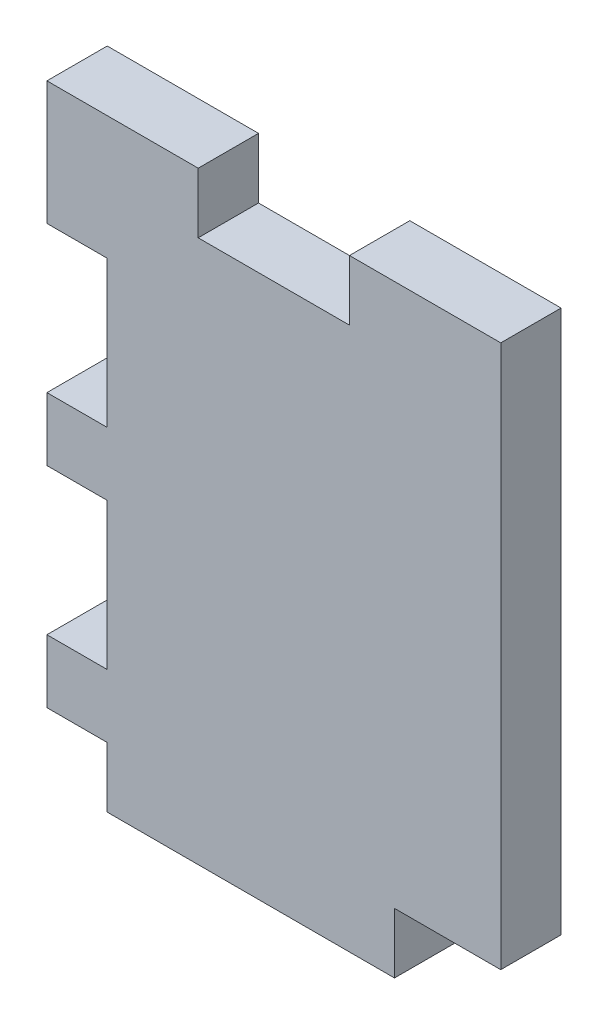
ISO-10303-21;
HEADER;
FILE_DESCRIPTION(('STEP AP214'),'2;1');
FILE_NAME('part.step','',(''),(''),'','','');
FILE_SCHEMA(('AUTOMOTIVE_DESIGN { 1 0 10303 214 1 1 1 1 }'));
ENDSEC;
DATA;
#1=APPLICATION_CONTEXT('core data for automotive mechanical design processes');
#2=APPLICATION_PROTOCOL_DEFINITION('international standard','automotive_design',2000,#1);
#3=PRODUCT_CONTEXT('',#1,'mechanical');
#4=PRODUCT('Part','Part','',(#3));
#5=PRODUCT_RELATED_PRODUCT_CATEGORY('part','',(#4));
#6=PRODUCT_DEFINITION_FORMATION('','',#4);
#7=PRODUCT_DEFINITION_CONTEXT('part definition',#1,'design');
#8=PRODUCT_DEFINITION('design','',#6,#7);
#9=PRODUCT_DEFINITION_SHAPE('','',#8);
#10=(LENGTH_UNIT() NAMED_UNIT(*) SI_UNIT(.MILLI.,.METRE.));
#11=(NAMED_UNIT(*) PLANE_ANGLE_UNIT() SI_UNIT($,.RADIAN.));
#12=(NAMED_UNIT(*) SI_UNIT($,.STERADIAN.) SOLID_ANGLE_UNIT());
#13=UNCERTAINTY_MEASURE_WITH_UNIT(LENGTH_MEASURE(1.E-05),#10,'distance_accuracy_value','');
#14=(GEOMETRIC_REPRESENTATION_CONTEXT(3) GLOBAL_UNCERTAINTY_ASSIGNED_CONTEXT((#13)) GLOBAL_UNIT_ASSIGNED_CONTEXT((#10,
#11,#12)) REPRESENTATION_CONTEXT('',''));
#15=CARTESIAN_POINT('',(0.,0.,0.));
#16=DIRECTION('',(0.,0.,1.));
#17=DIRECTION('',(1.,0.,0.));
#18=AXIS2_PLACEMENT_3D('',#15,#16,#17);
#19=CARTESIAN_POINT('',(0.,53.34,5.334));
#20=DIRECTION('',(0.,1.,0.));
#21=DIRECTION('',(0.,0.,1.));
#22=AXIS2_PLACEMENT_3D('',#19,#20,#21);
#23=PLANE('',#22);
#24=DIRECTION('',(0.,0.,1.));
#25=VECTOR('',#24,1.);
#26=CARTESIAN_POINT('',(13.3773333333333,53.34,0.));
#27=LINE('',#26,#25);
#28=CARTESIAN_POINT('',(13.3773333333333,53.34,0.));
#29=VERTEX_POINT('',#28);
#30=CARTESIAN_POINT('',(13.3773333333333,53.34,5.334));
#31=VERTEX_POINT('',#30);
#32=EDGE_CURVE('E205',#29,#31,#27,.T.);
#33=ORIENTED_EDGE('',*,*,#32,.F.);
#34=DIRECTION('',(1.,0.,0.));
#35=VECTOR('',#34,1.);
#36=CARTESIAN_POINT('',(0.,53.34,0.));
#37=LINE('',#36,#35);
#38=CARTESIAN_POINT('',(0.,53.34,0.));
#39=VERTEX_POINT('',#38);
#40=EDGE_CURVE('E197',#39,#29,#37,.T.);
#41=ORIENTED_EDGE('',*,*,#40,.F.);
#42=DIRECTION('',(0.,0.,-1.));
#43=VECTOR('',#42,1.);
#44=CARTESIAN_POINT('',(0.,53.34,5.334));
#45=LINE('',#44,#43);
#46=CARTESIAN_POINT('',(0.,53.34,5.334));
#47=VERTEX_POINT('',#46);
#48=EDGE_CURVE('E45',#47,#39,#45,.T.);
#49=ORIENTED_EDGE('',*,*,#48,.F.);
#50=DIRECTION('',(1.,0.,0.));
#51=VECTOR('',#50,1.);
#52=CARTESIAN_POINT('',(0.,53.34,5.334));
#53=LINE('',#52,#51);
#54=EDGE_CURVE('E306',#47,#31,#53,.T.);
#55=ORIENTED_EDGE('',*,*,#54,.T.);
#56=EDGE_LOOP('',(#33,#41,#49,#55));
#57=FACE_BOUND('',#56,.T.);
#58=ADVANCED_FACE('F37',(#57),#23,.T.);
#59=CARTESIAN_POINT('',(0.,0.,5.334));
#60=DIRECTION('',(-1.,0.,0.));
#61=DIRECTION('',(0.,-1.,0.));
#62=AXIS2_PLACEMENT_3D('',#59,#60,#61);
#63=PLANE('',#62);
#64=DIRECTION('',(0.,1.,0.));
#65=VECTOR('',#64,1.);
#66=CARTESIAN_POINT('',(0.,0.,0.));
#67=LINE('',#66,#65);
#68=CARTESIAN_POINT('',(0.,42.418,0.));
#69=VERTEX_POINT('',#68);
#70=EDGE_CURVE('E321',#69,#39,#67,.T.);
#71=ORIENTED_EDGE('',*,*,#70,.F.);
#72=DIRECTION('',(0.,0.,1.));
#73=VECTOR('',#72,1.);
#74=CARTESIAN_POINT('',(0.,42.418,0.));
#75=LINE('',#74,#73);
#76=CARTESIAN_POINT('',(0.,42.418,5.334));
#77=VERTEX_POINT('',#76);
#78=EDGE_CURVE('E232',#69,#77,#75,.T.);
#79=ORIENTED_EDGE('',*,*,#78,.T.);
#80=DIRECTION('',(0.,1.,0.));
#81=VECTOR('',#80,1.);
#82=CARTESIAN_POINT('',(0.,0.,5.334));
#83=LINE('',#82,#81);
#84=EDGE_CURVE('E309',#77,#47,#83,.T.);
#85=ORIENTED_EDGE('',*,*,#84,.T.);
#86=ORIENTED_EDGE('',*,*,#48,.T.);
#87=EDGE_LOOP('',(#71,#79,#85,#86));
#88=FACE_BOUND('',#87,.T.);
#89=ADVANCED_FACE('F328',(#88),#63,.T.);
#90=DIRECTION('',(0.,0.,1.));
#91=VECTOR('',#90,1.);
#92=CARTESIAN_POINT('',(0.,29.464,0.));
#93=LINE('',#92,#91);
#94=CARTESIAN_POINT('',(0.,29.464,0.));
#95=VERTEX_POINT('',#94);
#96=CARTESIAN_POINT('',(0.,29.464,5.334));
#97=VERTEX_POINT('',#96);
#98=EDGE_CURVE('E229',#95,#97,#93,.T.);
#99=ORIENTED_EDGE('',*,*,#98,.F.);
#100=CARTESIAN_POINT('',(0.,23.876,0.));
#101=VERTEX_POINT('',#100);
#102=EDGE_CURVE('E323',#101,#95,#67,.T.);
#103=ORIENTED_EDGE('',*,*,#102,.F.);
#104=DIRECTION('',(0.,0.,1.));
#105=VECTOR('',#104,1.);
#106=CARTESIAN_POINT('',(0.,23.876,0.));
#107=LINE('',#106,#105);
#108=CARTESIAN_POINT('',(0.,23.876,5.334));
#109=VERTEX_POINT('',#108);
#110=EDGE_CURVE('E242',#101,#109,#107,.T.);
#111=ORIENTED_EDGE('',*,*,#110,.T.);
#112=EDGE_CURVE('E313',#109,#97,#83,.T.);
#113=ORIENTED_EDGE('',*,*,#112,.T.);
#114=EDGE_LOOP('',(#99,#103,#111,#113));
#115=FACE_BOUND('',#114,.T.);
#116=ADVANCED_FACE('F384',(#115),#63,.T.);
#117=CARTESIAN_POINT('',(0.,0.,5.334));
#118=DIRECTION('',(0.,0.,1.));
#119=DIRECTION('',(1.,0.,0.));
#120=AXIS2_PLACEMENT_3D('',#117,#118,#119);
#121=PLANE('',#120);
#122=DIRECTION('',(0.,-1.,0.));
#123=VECTOR('',#122,1.);
#124=CARTESIAN_POINT('',(13.3773333333333,53.34,5.334));
#125=LINE('',#124,#123);
#126=CARTESIAN_POINT('',(13.3773333333333,48.006,5.334));
#127=VERTEX_POINT('',#126);
#128=EDGE_CURVE('E180',#31,#127,#125,.T.);
#129=ORIENTED_EDGE('',*,*,#128,.F.);
#130=ORIENTED_EDGE('',*,*,#54,.F.);
#131=ORIENTED_EDGE('',*,*,#84,.F.);
#132=DIRECTION('',(1.,0.,0.));
#133=VECTOR('',#132,1.);
#134=CARTESIAN_POINT('',(0.,42.418,5.334));
#135=LINE('',#134,#133);
#136=CARTESIAN_POINT('',(5.334,42.418,5.334));
#137=VERTEX_POINT('',#136);
#138=EDGE_CURVE('E215',#77,#137,#135,.T.);
#139=ORIENTED_EDGE('',*,*,#138,.T.);
#140=DIRECTION('',(0.,-1.,0.));
#141=VECTOR('',#140,1.);
#142=CARTESIAN_POINT('',(5.334,42.418,5.334));
#143=LINE('',#142,#141);
#144=CARTESIAN_POINT('',(5.334,29.464,5.334));
#145=VERTEX_POINT('',#144);
#146=EDGE_CURVE('E223',#137,#145,#143,.T.);
#147=ORIENTED_EDGE('',*,*,#146,.T.);
#148=DIRECTION('',(1.,0.,0.));
#149=VECTOR('',#148,1.);
#150=CARTESIAN_POINT('',(0.,29.464,5.334));
#151=LINE('',#150,#149);
#152=EDGE_CURVE('E220',#97,#145,#151,.T.);
#153=ORIENTED_EDGE('',*,*,#152,.F.);
#154=ORIENTED_EDGE('',*,*,#112,.F.);
#155=DIRECTION('',(1.,0.,0.));
#156=VECTOR('',#155,1.);
#157=CARTESIAN_POINT('',(0.,23.876,5.334));
#158=LINE('',#157,#156);
#159=CARTESIAN_POINT('',(5.334,23.876,5.334));
#160=VERTEX_POINT('',#159);
#161=EDGE_CURVE('E224',#109,#160,#158,.T.);
#162=ORIENTED_EDGE('',*,*,#161,.T.);
#163=DIRECTION('',(0.,1.,0.));
#164=VECTOR('',#163,1.);
#165=CARTESIAN_POINT('',(5.334,10.922,5.334));
#166=LINE('',#165,#164);
#167=CARTESIAN_POINT('',(5.334,10.922,5.334));
#168=VERTEX_POINT('',#167);
#169=EDGE_CURVE('E249',#168,#160,#166,.T.);
#170=ORIENTED_EDGE('',*,*,#169,.F.);
#171=DIRECTION('',(1.,0.,0.));
#172=VECTOR('',#171,1.);
#173=CARTESIAN_POINT('',(0.,10.922,5.334));
#174=LINE('',#173,#172);
#175=CARTESIAN_POINT('',(0.,10.922,5.334));
#176=VERTEX_POINT('',#175);
#177=EDGE_CURVE('E246',#176,#168,#174,.T.);
#178=ORIENTED_EDGE('',*,*,#177,.F.);
#179=CARTESIAN_POINT('',(0.,5.334,5.334));
#180=VERTEX_POINT('',#179);
#181=EDGE_CURVE('E310',#180,#176,#83,.T.);
#182=ORIENTED_EDGE('',*,*,#181,.F.);
#183=DIRECTION('',(1.,0.,0.));
#184=VECTOR('',#183,1.);
#185=CARTESIAN_POINT('',(0.,5.334,5.334));
#186=LINE('',#185,#184);
#187=CARTESIAN_POINT('',(5.334,5.334,5.334));
#188=VERTEX_POINT('',#187);
#189=EDGE_CURVE('E269',#180,#188,#186,.T.);
#190=ORIENTED_EDGE('',*,*,#189,.T.);
#191=DIRECTION('',(0.,1.,0.));
#192=VECTOR('',#191,1.);
#193=CARTESIAN_POINT('',(5.334,0.,5.334));
#194=LINE('',#193,#192);
#195=CARTESIAN_POINT('',(5.334,0.,5.334));
#196=VERTEX_POINT('',#195);
#197=EDGE_CURVE('E265',#196,#188,#194,.T.);
#198=ORIENTED_EDGE('',*,*,#197,.F.);
#199=DIRECTION('',(1.,0.,0.));
#200=VECTOR('',#199,1.);
#201=CARTESIAN_POINT('',(0.,0.,5.334));
#202=LINE('',#201,#200);
#203=CARTESIAN_POINT('',(30.734,0.,5.334));
#204=VERTEX_POINT('',#203);
#205=EDGE_CURVE('E298',#196,#204,#202,.T.);
#206=ORIENTED_EDGE('',*,*,#205,.T.);
#207=DIRECTION('',(0.,1.,0.));
#208=VECTOR('',#207,1.);
#209=CARTESIAN_POINT('',(30.734,0.,5.334));
#210=LINE('',#209,#208);
#211=CARTESIAN_POINT('',(30.734,5.334,5.334));
#212=VERTEX_POINT('',#211);
#213=EDGE_CURVE('E289',#204,#212,#210,.T.);
#214=ORIENTED_EDGE('',*,*,#213,.T.);
#215=DIRECTION('',(-1.,0.,0.));
#216=VECTOR('',#215,1.);
#217=CARTESIAN_POINT('',(40.132,5.334,5.334));
#218=LINE('',#217,#216);
#219=CARTESIAN_POINT('',(40.132,5.334,5.334));
#220=VERTEX_POINT('',#219);
#221=EDGE_CURVE('E272',#220,#212,#218,.T.);
#222=ORIENTED_EDGE('',*,*,#221,.F.);
#223=DIRECTION('',(0.,1.,0.));
#224=VECTOR('',#223,1.);
#225=CARTESIAN_POINT('',(40.132,0.,5.334));
#226=LINE('',#225,#224);
#227=CARTESIAN_POINT('',(40.132,53.34,5.334));
#228=VERTEX_POINT('',#227);
#229=EDGE_CURVE('E301',#220,#228,#226,.T.);
#230=ORIENTED_EDGE('',*,*,#229,.T.);
#231=CARTESIAN_POINT('',(26.7546666666667,53.34,5.334));
#232=VERTEX_POINT('',#231);
#233=EDGE_CURVE('E305',#232,#228,#53,.T.);
#234=ORIENTED_EDGE('',*,*,#233,.F.);
#235=DIRECTION('',(0.,1.,0.));
#236=VECTOR('',#235,1.);
#237=CARTESIAN_POINT('',(26.7546666666667,53.34,5.334));
#238=LINE('',#237,#236);
#239=CARTESIAN_POINT('',(26.7546666666667,48.006,5.334));
#240=VERTEX_POINT('',#239);
#241=EDGE_CURVE('E52',#240,#232,#238,.T.);
#242=ORIENTED_EDGE('',*,*,#241,.F.);
#243=DIRECTION('',(1.,0.,0.));
#244=VECTOR('',#243,1.);
#245=CARTESIAN_POINT('',(13.3773333333333,48.006,5.334));
#246=LINE('',#245,#244);
#247=EDGE_CURVE('E199',#127,#240,#246,.T.);
#248=ORIENTED_EDGE('',*,*,#247,.F.);
#249=EDGE_LOOP('',(#129,#130,#131,#139,#147,#153,#154,#162,#170,#178,#182,#190,#198,#206,#214,
#222,#230,#234,#242,#248));
#250=FACE_BOUND('',#249,.T.);
#251=ADVANCED_FACE('F333',(#250),#121,.T.);
#252=CARTESIAN_POINT('',(0.,0.,0.));
#253=DIRECTION('',(0.,0.,1.));
#254=DIRECTION('',(1.,0.,0.));
#255=AXIS2_PLACEMENT_3D('',#252,#253,#254);
#256=PLANE('',#255);
#257=ORIENTED_EDGE('',*,*,#40,.T.);
#258=DIRECTION('',(0.,-1.,0.));
#259=VECTOR('',#258,1.);
#260=CARTESIAN_POINT('',(13.3773333333333,53.34,0.));
#261=LINE('',#260,#259);
#262=CARTESIAN_POINT('',(13.3773333333333,48.006,0.));
#263=VERTEX_POINT('',#262);
#264=EDGE_CURVE('E177',#29,#263,#261,.T.);
#265=ORIENTED_EDGE('',*,*,#264,.T.);
#266=DIRECTION('',(1.,0.,0.));
#267=VECTOR('',#266,1.);
#268=CARTESIAN_POINT('',(13.3773333333333,48.006,0.));
#269=LINE('',#268,#267);
#270=CARTESIAN_POINT('',(26.7546666666667,48.006,0.));
#271=VERTEX_POINT('',#270);
#272=EDGE_CURVE('E188',#263,#271,#269,.T.);
#273=ORIENTED_EDGE('',*,*,#272,.T.);
#274=DIRECTION('',(0.,1.,0.));
#275=VECTOR('',#274,1.);
#276=CARTESIAN_POINT('',(26.7546666666667,53.34,0.));
#277=LINE('',#276,#275);
#278=CARTESIAN_POINT('',(26.7546666666667,53.34,0.));
#279=VERTEX_POINT('',#278);
#280=EDGE_CURVE('E185',#271,#279,#277,.T.);
#281=ORIENTED_EDGE('',*,*,#280,.T.);
#282=CARTESIAN_POINT('',(40.132,53.34,0.));
#283=VERTEX_POINT('',#282);
#284=EDGE_CURVE('E319',#279,#283,#37,.T.);
#285=ORIENTED_EDGE('',*,*,#284,.T.);
#286=DIRECTION('',(0.,1.,0.));
#287=VECTOR('',#286,1.);
#288=CARTESIAN_POINT('',(40.132,0.,0.));
#289=LINE('',#288,#287);
#290=CARTESIAN_POINT('',(40.132,5.334,0.));
#291=VERTEX_POINT('',#290);
#292=EDGE_CURVE('E316',#291,#283,#289,.T.);
#293=ORIENTED_EDGE('',*,*,#292,.F.);
#294=DIRECTION('',(-1.,0.,0.));
#295=VECTOR('',#294,1.);
#296=CARTESIAN_POINT('',(40.132,5.334,0.));
#297=LINE('',#296,#295);
#298=CARTESIAN_POINT('',(30.734,5.334,0.));
#299=VERTEX_POINT('',#298);
#300=EDGE_CURVE('E292',#291,#299,#297,.T.);
#301=ORIENTED_EDGE('',*,*,#300,.T.);
#302=DIRECTION('',(0.,1.,0.));
#303=VECTOR('',#302,1.);
#304=CARTESIAN_POINT('',(30.734,0.,0.));
#305=LINE('',#304,#303);
#306=CARTESIAN_POINT('',(30.734,0.,0.));
#307=VERTEX_POINT('',#306);
#308=EDGE_CURVE('E284',#307,#299,#305,.T.);
#309=ORIENTED_EDGE('',*,*,#308,.F.);
#310=DIRECTION('',(1.,0.,0.));
#311=VECTOR('',#310,1.);
#312=CARTESIAN_POINT('',(0.,0.,0.));
#313=LINE('',#312,#311);
#314=CARTESIAN_POINT('',(5.334,0.,0.));
#315=VERTEX_POINT('',#314);
#316=EDGE_CURVE('E281',#315,#307,#313,.T.);
#317=ORIENTED_EDGE('',*,*,#316,.F.);
#318=DIRECTION('',(0.,1.,0.));
#319=VECTOR('',#318,1.);
#320=CARTESIAN_POINT('',(5.334,0.,0.));
#321=LINE('',#320,#319);
#322=CARTESIAN_POINT('',(5.334,5.334,0.));
#323=VERTEX_POINT('',#322);
#324=EDGE_CURVE('E264',#315,#323,#321,.T.);
#325=ORIENTED_EDGE('',*,*,#324,.T.);
#326=DIRECTION('',(1.,0.,0.));
#327=VECTOR('',#326,1.);
#328=CARTESIAN_POINT('',(0.,5.334,0.));
#329=LINE('',#328,#327);
#330=CARTESIAN_POINT('',(0.,5.334,0.));
#331=VERTEX_POINT('',#330);
#332=EDGE_CURVE('E261',#331,#323,#329,.T.);
#333=ORIENTED_EDGE('',*,*,#332,.F.);
#334=CARTESIAN_POINT('',(0.,10.922,0.));
#335=VERTEX_POINT('',#334);
#336=EDGE_CURVE('E302',#331,#335,#67,.T.);
#337=ORIENTED_EDGE('',*,*,#336,.T.);
#338=DIRECTION('',(1.,0.,0.));
#339=VECTOR('',#338,1.);
#340=CARTESIAN_POINT('',(0.,10.922,0.));
#341=LINE('',#340,#339);
#342=CARTESIAN_POINT('',(5.334,10.922,0.));
#343=VERTEX_POINT('',#342);
#344=EDGE_CURVE('E245',#335,#343,#341,.T.);
#345=ORIENTED_EDGE('',*,*,#344,.T.);
#346=DIRECTION('',(0.,1.,0.));
#347=VECTOR('',#346,1.);
#348=CARTESIAN_POINT('',(5.334,10.922,0.));
#349=LINE('',#348,#347);
#350=CARTESIAN_POINT('',(5.334,23.876,0.));
#351=VERTEX_POINT('',#350);
#352=EDGE_CURVE('E257',#343,#351,#349,.T.);
#353=ORIENTED_EDGE('',*,*,#352,.T.);
#354=DIRECTION('',(1.,0.,0.));
#355=VECTOR('',#354,1.);
#356=CARTESIAN_POINT('',(0.,23.876,0.));
#357=LINE('',#356,#355);
#358=EDGE_CURVE('E250',#101,#351,#357,.T.);
#359=ORIENTED_EDGE('',*,*,#358,.F.);
#360=ORIENTED_EDGE('',*,*,#102,.T.);
#361=DIRECTION('',(1.,0.,0.));
#362=VECTOR('',#361,1.);
#363=CARTESIAN_POINT('',(0.,29.464,0.));
#364=LINE('',#363,#362);
#365=CARTESIAN_POINT('',(5.334,29.464,0.));
#366=VERTEX_POINT('',#365);
#367=EDGE_CURVE('E211',#95,#366,#364,.T.);
#368=ORIENTED_EDGE('',*,*,#367,.T.);
#369=DIRECTION('',(0.,-1.,0.));
#370=VECTOR('',#369,1.);
#371=CARTESIAN_POINT('',(5.334,42.418,0.));
#372=LINE('',#371,#370);
#373=CARTESIAN_POINT('',(5.334,42.418,0.));
#374=VERTEX_POINT('',#373);
#375=EDGE_CURVE('E214',#374,#366,#372,.T.);
#376=ORIENTED_EDGE('',*,*,#375,.F.);
#377=DIRECTION('',(1.,0.,0.));
#378=VECTOR('',#377,1.);
#379=CARTESIAN_POINT('',(0.,42.418,0.));
#380=LINE('',#379,#378);
#381=EDGE_CURVE('E217',#69,#374,#380,.T.);
#382=ORIENTED_EDGE('',*,*,#381,.F.);
#383=ORIENTED_EDGE('',*,*,#70,.T.);
#384=EDGE_LOOP('',(#257,#265,#273,#281,#285,#293,#301,#309,#317,#325,#333,#337,#345,#353,#359,
#360,#368,#376,#382,#383));
#385=FACE_BOUND('',#384,.T.);
#386=ADVANCED_FACE('F195',(#385),#256,.F.);
#387=CARTESIAN_POINT('',(0.,0.,5.334));
#388=DIRECTION('',(0.,1.,0.));
#389=DIRECTION('',(0.,0.,1.));
#390=AXIS2_PLACEMENT_3D('',#387,#388,#389);
#391=PLANE('',#390);
#392=ORIENTED_EDGE('',*,*,#205,.F.);
#393=DIRECTION('',(0.,0.,1.));
#394=VECTOR('',#393,1.);
#395=CARTESIAN_POINT('',(5.334,0.,0.));
#396=LINE('',#395,#394);
#397=EDGE_CURVE('E277',#315,#196,#396,.T.);
#398=ORIENTED_EDGE('',*,*,#397,.F.);
#399=ORIENTED_EDGE('',*,*,#316,.T.);
#400=DIRECTION('',(0.,0.,1.));
#401=VECTOR('',#400,1.);
#402=CARTESIAN_POINT('',(30.734,0.,0.));
#403=LINE('',#402,#401);
#404=EDGE_CURVE('E285',#307,#204,#403,.T.);
#405=ORIENTED_EDGE('',*,*,#404,.T.);
#406=EDGE_LOOP('',(#392,#398,#399,#405));
#407=FACE_BOUND('',#406,.T.);
#408=ADVANCED_FACE('F39',(#407),#391,.F.);
#409=DIRECTION('',(0.,0.,1.));
#410=VECTOR('',#409,1.);
#411=CARTESIAN_POINT('',(0.,10.922,0.));
#412=LINE('',#411,#410);
#413=EDGE_CURVE('E240',#335,#176,#412,.T.);
#414=ORIENTED_EDGE('',*,*,#413,.F.);
#415=ORIENTED_EDGE('',*,*,#336,.F.);
#416=DIRECTION('',(0.,0.,1.));
#417=VECTOR('',#416,1.);
#418=CARTESIAN_POINT('',(0.,5.334,0.));
#419=LINE('',#418,#417);
#420=EDGE_CURVE('E268',#331,#180,#419,.T.);
#421=ORIENTED_EDGE('',*,*,#420,.T.);
#422=ORIENTED_EDGE('',*,*,#181,.T.);
#423=EDGE_LOOP('',(#414,#415,#421,#422));
#424=FACE_BOUND('',#423,.T.);
#425=ADVANCED_FACE('F366',(#424),#63,.T.);
#426=CARTESIAN_POINT('',(40.132,0.,5.334));
#427=DIRECTION('',(-1.,0.,0.));
#428=DIRECTION('',(0.,-1.,0.));
#429=AXIS2_PLACEMENT_3D('',#426,#427,#428);
#430=PLANE('',#429);
#431=ORIENTED_EDGE('',*,*,#229,.F.);
#432=DIRECTION('',(0.,0.,1.));
#433=VECTOR('',#432,1.);
#434=CARTESIAN_POINT('',(40.132,5.334,0.));
#435=LINE('',#434,#433);
#436=EDGE_CURVE('E231',#291,#220,#435,.T.);
#437=ORIENTED_EDGE('',*,*,#436,.F.);
#438=ORIENTED_EDGE('',*,*,#292,.T.);
#439=DIRECTION('',(0.,0.,-1.));
#440=VECTOR('',#439,1.);
#441=CARTESIAN_POINT('',(40.132,53.34,5.334));
#442=LINE('',#441,#440);
#443=EDGE_CURVE('E11',#228,#283,#442,.T.);
#444=ORIENTED_EDGE('',*,*,#443,.F.);
#445=EDGE_LOOP('',(#431,#437,#438,#444));
#446=FACE_BOUND('',#445,.T.);
#447=ADVANCED_FACE('F345',(#446),#430,.F.);
#448=DIRECTION('',(0.,0.,1.));
#449=VECTOR('',#448,1.);
#450=CARTESIAN_POINT('',(26.7546666666667,53.34,0.));
#451=LINE('',#450,#449);
#452=EDGE_CURVE('E208',#279,#232,#451,.T.);
#453=ORIENTED_EDGE('',*,*,#452,.T.);
#454=ORIENTED_EDGE('',*,*,#233,.T.);
#455=ORIENTED_EDGE('',*,*,#443,.T.);
#456=ORIENTED_EDGE('',*,*,#284,.F.);
#457=EDGE_LOOP('',(#453,#454,#455,#456));
#458=FACE_BOUND('',#457,.T.);
#459=ADVANCED_FACE('F339',(#458),#23,.T.);
#460=CARTESIAN_POINT('',(40.132,5.334,0.));
#461=DIRECTION('',(0.,1.,0.));
#462=DIRECTION('',(-1.,0.,0.));
#463=AXIS2_PLACEMENT_3D('',#460,#461,#462);
#464=PLANE('',#463);
#465=ORIENTED_EDGE('',*,*,#221,.T.);
#466=DIRECTION('',(0.,0.,1.));
#467=VECTOR('',#466,1.);
#468=CARTESIAN_POINT('',(30.734,5.334,0.));
#469=LINE('',#468,#467);
#470=EDGE_CURVE('E282',#299,#212,#469,.T.);
#471=ORIENTED_EDGE('',*,*,#470,.F.);
#472=ORIENTED_EDGE('',*,*,#300,.F.);
#473=ORIENTED_EDGE('',*,*,#436,.T.);
#474=EDGE_LOOP('',(#465,#471,#472,#473));
#475=FACE_BOUND('',#474,.T.);
#476=ADVANCED_FACE('F347',(#475),#464,.F.);
#477=CARTESIAN_POINT('',(30.734,0.,0.));
#478=DIRECTION('',(1.,0.,0.));
#479=DIRECTION('',(0.,0.,-1.));
#480=AXIS2_PLACEMENT_3D('',#477,#478,#479);
#481=PLANE('',#480);
#482=ORIENTED_EDGE('',*,*,#213,.F.);
#483=ORIENTED_EDGE('',*,*,#404,.F.);
#484=ORIENTED_EDGE('',*,*,#308,.T.);
#485=ORIENTED_EDGE('',*,*,#470,.T.);
#486=EDGE_LOOP('',(#482,#483,#484,#485));
#487=FACE_BOUND('',#486,.T.);
#488=ADVANCED_FACE('F352',(#487),#481,.T.);
#489=CARTESIAN_POINT('',(0.,5.334,0.));
#490=DIRECTION('',(0.,-1.,0.));
#491=DIRECTION('',(0.,0.,-1.));
#492=AXIS2_PLACEMENT_3D('',#489,#490,#491);
#493=PLANE('',#492);
#494=ORIENTED_EDGE('',*,*,#189,.F.);
#495=ORIENTED_EDGE('',*,*,#420,.F.);
#496=ORIENTED_EDGE('',*,*,#332,.T.);
#497=DIRECTION('',(0.,0.,1.));
#498=VECTOR('',#497,1.);
#499=CARTESIAN_POINT('',(5.334,5.334,0.));
#500=LINE('',#499,#498);
#501=EDGE_CURVE('E279',#323,#188,#500,.T.);
#502=ORIENTED_EDGE('',*,*,#501,.T.);
#503=EDGE_LOOP('',(#494,#495,#496,#502));
#504=FACE_BOUND('',#503,.T.);
#505=ADVANCED_FACE('F362',(#504),#493,.T.);
#506=CARTESIAN_POINT('',(5.334,0.,0.));
#507=DIRECTION('',(1.,0.,0.));
#508=DIRECTION('',(0.,1.,0.));
#509=AXIS2_PLACEMENT_3D('',#506,#507,#508);
#510=PLANE('',#509);
#511=ORIENTED_EDGE('',*,*,#197,.T.);
#512=ORIENTED_EDGE('',*,*,#501,.F.);
#513=ORIENTED_EDGE('',*,*,#324,.F.);
#514=ORIENTED_EDGE('',*,*,#397,.T.);
#515=EDGE_LOOP('',(#511,#512,#513,#514));
#516=FACE_BOUND('',#515,.T.);
#517=ADVANCED_FACE('F360',(#516),#510,.F.);
#518=CARTESIAN_POINT('',(0.,23.876,0.));
#519=DIRECTION('',(0.,-1.,0.));
#520=DIRECTION('',(1.,0.,0.));
#521=AXIS2_PLACEMENT_3D('',#518,#519,#520);
#522=PLANE('',#521);
#523=ORIENTED_EDGE('',*,*,#161,.F.);
#524=ORIENTED_EDGE('',*,*,#110,.F.);
#525=ORIENTED_EDGE('',*,*,#358,.T.);
#526=DIRECTION('',(0.,0.,1.));
#527=VECTOR('',#526,1.);
#528=CARTESIAN_POINT('',(5.334,23.876,0.));
#529=LINE('',#528,#527);
#530=EDGE_CURVE('E207',#351,#160,#529,.T.);
#531=ORIENTED_EDGE('',*,*,#530,.T.);
#532=EDGE_LOOP('',(#523,#524,#525,#531));
#533=FACE_BOUND('',#532,.T.);
#534=ADVANCED_FACE('F379',(#533),#522,.T.);
#535=CARTESIAN_POINT('',(5.334,10.922,0.));
#536=DIRECTION('',(1.,0.,0.));
#537=DIRECTION('',(0.,0.,-1.));
#538=AXIS2_PLACEMENT_3D('',#535,#536,#537);
#539=PLANE('',#538);
#540=ORIENTED_EDGE('',*,*,#169,.T.);
#541=ORIENTED_EDGE('',*,*,#530,.F.);
#542=ORIENTED_EDGE('',*,*,#352,.F.);
#543=DIRECTION('',(0.,0.,1.));
#544=VECTOR('',#543,1.);
#545=CARTESIAN_POINT('',(5.334,10.922,0.));
#546=LINE('',#545,#544);
#547=EDGE_CURVE('E238',#343,#168,#546,.T.);
#548=ORIENTED_EDGE('',*,*,#547,.T.);
#549=EDGE_LOOP('',(#540,#541,#542,#548));
#550=FACE_BOUND('',#549,.T.);
#551=ADVANCED_FACE('F377',(#550),#539,.F.);
#552=CARTESIAN_POINT('',(0.,10.922,0.));
#553=DIRECTION('',(0.,-1.,0.));
#554=DIRECTION('',(0.,0.,-1.));
#555=AXIS2_PLACEMENT_3D('',#552,#553,#554);
#556=PLANE('',#555);
#557=ORIENTED_EDGE('',*,*,#177,.T.);
#558=ORIENTED_EDGE('',*,*,#547,.F.);
#559=ORIENTED_EDGE('',*,*,#344,.F.);
#560=ORIENTED_EDGE('',*,*,#413,.T.);
#561=EDGE_LOOP('',(#557,#558,#559,#560));
#562=FACE_BOUND('',#561,.T.);
#563=ADVANCED_FACE('F371',(#562),#556,.F.);
#564=CARTESIAN_POINT('',(0.,29.464,0.));
#565=DIRECTION('',(0.,-1.,0.));
#566=DIRECTION('',(0.,0.,-1.));
#567=AXIS2_PLACEMENT_3D('',#564,#565,#566);
#568=PLANE('',#567);
#569=ORIENTED_EDGE('',*,*,#152,.T.);
#570=DIRECTION('',(0.,0.,1.));
#571=VECTOR('',#570,1.);
#572=CARTESIAN_POINT('',(5.334,29.464,0.));
#573=LINE('',#572,#571);
#574=EDGE_CURVE('E219',#366,#145,#573,.T.);
#575=ORIENTED_EDGE('',*,*,#574,.F.);
#576=ORIENTED_EDGE('',*,*,#367,.F.);
#577=ORIENTED_EDGE('',*,*,#98,.T.);
#578=EDGE_LOOP('',(#569,#575,#576,#577));
#579=FACE_BOUND('',#578,.T.);
#580=ADVANCED_FACE('F388',(#579),#568,.F.);
#581=CARTESIAN_POINT('',(0.,42.418,0.));
#582=DIRECTION('',(0.,-1.,0.));
#583=DIRECTION('',(0.,0.,-1.));
#584=AXIS2_PLACEMENT_3D('',#581,#582,#583);
#585=PLANE('',#584);
#586=ORIENTED_EDGE('',*,*,#138,.F.);
#587=ORIENTED_EDGE('',*,*,#78,.F.);
#588=ORIENTED_EDGE('',*,*,#381,.T.);
#589=DIRECTION('',(0.,0.,1.));
#590=VECTOR('',#589,1.);
#591=CARTESIAN_POINT('',(5.334,42.418,0.));
#592=LINE('',#591,#590);
#593=EDGE_CURVE('E60',#374,#137,#592,.T.);
#594=ORIENTED_EDGE('',*,*,#593,.T.);
#595=EDGE_LOOP('',(#586,#587,#588,#594));
#596=FACE_BOUND('',#595,.T.);
#597=ADVANCED_FACE('F392',(#596),#585,.T.);
#598=CARTESIAN_POINT('',(5.334,42.418,0.));
#599=DIRECTION('',(-1.,0.,0.));
#600=DIRECTION('',(0.,-1.,0.));
#601=AXIS2_PLACEMENT_3D('',#598,#599,#600);
#602=PLANE('',#601);
#603=ORIENTED_EDGE('',*,*,#146,.F.);
#604=ORIENTED_EDGE('',*,*,#593,.F.);
#605=ORIENTED_EDGE('',*,*,#375,.T.);
#606=ORIENTED_EDGE('',*,*,#574,.T.);
#607=EDGE_LOOP('',(#603,#604,#605,#606));
#608=FACE_BOUND('',#607,.T.);
#609=ADVANCED_FACE('F393',(#608),#602,.T.);
#610=CARTESIAN_POINT('',(13.3773333333333,53.34,0.));
#611=DIRECTION('',(-1.,0.,0.));
#612=DIRECTION('',(0.,-1.,0.));
#613=AXIS2_PLACEMENT_3D('',#610,#611,#612);
#614=PLANE('',#613);
#615=ORIENTED_EDGE('',*,*,#128,.T.);
#616=DIRECTION('',(0.,0.,1.));
#617=VECTOR('',#616,1.);
#618=CARTESIAN_POINT('',(13.3773333333333,48.006,0.));
#619=LINE('',#618,#617);
#620=EDGE_CURVE('E173',#263,#127,#619,.T.);
#621=ORIENTED_EDGE('',*,*,#620,.F.);
#622=ORIENTED_EDGE('',*,*,#264,.F.);
#623=ORIENTED_EDGE('',*,*,#32,.T.);
#624=EDGE_LOOP('',(#615,#621,#622,#623));
#625=FACE_BOUND('',#624,.T.);
#626=ADVANCED_FACE('F175',(#625),#614,.F.);
#627=CARTESIAN_POINT('',(26.7546666666667,53.34,0.));
#628=DIRECTION('',(1.,0.,0.));
#629=DIRECTION('',(0.,1.,0.));
#630=AXIS2_PLACEMENT_3D('',#627,#628,#629);
#631=PLANE('',#630);
#632=ORIENTED_EDGE('',*,*,#241,.T.);
#633=ORIENTED_EDGE('',*,*,#452,.F.);
#634=ORIENTED_EDGE('',*,*,#280,.F.);
#635=DIRECTION('',(0.,0.,1.));
#636=VECTOR('',#635,1.);
#637=CARTESIAN_POINT('',(26.7546666666667,48.006,0.));
#638=LINE('',#637,#636);
#639=EDGE_CURVE('E184',#271,#240,#638,.T.);
#640=ORIENTED_EDGE('',*,*,#639,.T.);
#641=EDGE_LOOP('',(#632,#633,#634,#640));
#642=FACE_BOUND('',#641,.T.);
#643=ADVANCED_FACE('F341',(#642),#631,.F.);
#644=CARTESIAN_POINT('',(13.3773333333333,48.006,0.));
#645=DIRECTION('',(0.,-1.,0.));
#646=DIRECTION('',(1.,0.,0.));
#647=AXIS2_PLACEMENT_3D('',#644,#645,#646);
#648=PLANE('',#647);
#649=ORIENTED_EDGE('',*,*,#247,.T.);
#650=ORIENTED_EDGE('',*,*,#639,.F.);
#651=ORIENTED_EDGE('',*,*,#272,.F.);
#652=ORIENTED_EDGE('',*,*,#620,.T.);
#653=EDGE_LOOP('',(#649,#650,#651,#652));
#654=FACE_BOUND('',#653,.T.);
#655=ADVANCED_FACE('F189',(#654),#648,.F.);
#656=CLOSED_SHELL('',(#58,#89,#116,#251,#386,#408,#425,#447,#459,#476,#488,#505,#517,#534,#551,
#563,#580,#597,#609,#626,#643,#655));
#657=MANIFOLD_SOLID_BREP('B2',#656);
#658=ADVANCED_BREP_SHAPE_REPRESENTATION('',(#18,#657),#14);
#659=SHAPE_DEFINITION_REPRESENTATION(#9,#658);
ENDSEC;
END-ISO-10303-21;
